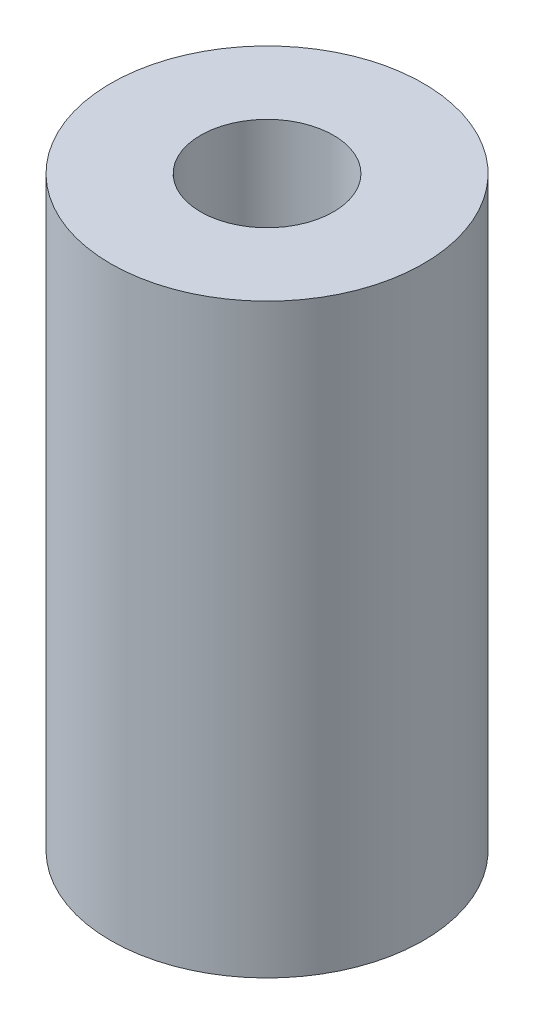
ISO-10303-21;
HEADER;
FILE_DESCRIPTION(('STEP AP214'),'2;1');
FILE_NAME('part.step','',(''),(''),'','','');
FILE_SCHEMA(('AUTOMOTIVE_DESIGN { 1 0 10303 214 1 1 1 1 }'));
ENDSEC;
DATA;
#1=APPLICATION_CONTEXT('core data for automotive mechanical design processes');
#2=APPLICATION_PROTOCOL_DEFINITION('international standard','automotive_design',2000,#1);
#3=PRODUCT_CONTEXT('',#1,'mechanical');
#4=PRODUCT('Part','Part','',(#3));
#5=PRODUCT_RELATED_PRODUCT_CATEGORY('part','',(#4));
#6=PRODUCT_DEFINITION_FORMATION('','',#4);
#7=PRODUCT_DEFINITION_CONTEXT('part definition',#1,'design');
#8=PRODUCT_DEFINITION('design','',#6,#7);
#9=PRODUCT_DEFINITION_SHAPE('','',#8);
#10=(LENGTH_UNIT() NAMED_UNIT(*) SI_UNIT(.MILLI.,.METRE.));
#11=(NAMED_UNIT(*) PLANE_ANGLE_UNIT() SI_UNIT($,.RADIAN.));
#12=(NAMED_UNIT(*) SI_UNIT($,.STERADIAN.) SOLID_ANGLE_UNIT());
#13=UNCERTAINTY_MEASURE_WITH_UNIT(LENGTH_MEASURE(1.E-05),#10,'distance_accuracy_value','');
#14=(GEOMETRIC_REPRESENTATION_CONTEXT(3) GLOBAL_UNCERTAINTY_ASSIGNED_CONTEXT((#13)) GLOBAL_UNIT_ASSIGNED_CONTEXT((#10,
#11,#12)) REPRESENTATION_CONTEXT('',''));
#15=CARTESIAN_POINT('',(0.,0.,0.));
#16=DIRECTION('',(0.,0.,1.));
#17=DIRECTION('',(1.,0.,0.));
#18=AXIS2_PLACEMENT_3D('',#15,#16,#17);
#19=CARTESIAN_POINT('',(0.,15.,0.));
#20=DIRECTION('',(0.,1.,0.));
#21=DIRECTION('',(0.,0.,1.));
#22=AXIS2_PLACEMENT_3D('',#19,#20,#21);
#23=PLANE('',#22);
#24=CARTESIAN_POINT('',(0.,15.,0.));
#25=DIRECTION('',(0.,1.,0.));
#26=DIRECTION('',(0.,0.,1.));
#27=AXIS2_PLACEMENT_3D('',#24,#25,#26);
#28=CIRCLE('',#27,4.);
#29=CARTESIAN_POINT('',(0.,15.,4.));
#30=VERTEX_POINT('',#29);
#31=EDGE_CURVE('E10',#30,#30,#28,.T.);
#32=ORIENTED_EDGE('',*,*,#31,.T.);
#33=EDGE_LOOP('',(#32));
#34=FACE_BOUND('',#33,.T.);
#35=CARTESIAN_POINT('',(0.,15.,0.));
#36=DIRECTION('',(0.,1.,0.));
#37=DIRECTION('',(0.,0.,1.));
#38=AXIS2_PLACEMENT_3D('',#35,#36,#37);
#39=CIRCLE('',#38,1.7);
#40=CARTESIAN_POINT('',(0.,15.,1.7));
#41=VERTEX_POINT('',#40);
#42=EDGE_CURVE('E43',#41,#41,#39,.T.);
#43=ORIENTED_EDGE('',*,*,#42,.F.);
#44=EDGE_LOOP('',(#43));
#45=FACE_BOUND('',#44,.T.);
#46=ADVANCED_FACE('F32',(#34,#45),#23,.T.);
#47=CARTESIAN_POINT('',(0.,0.,0.));
#48=DIRECTION('',(0.,1.,0.));
#49=DIRECTION('',(0.,0.,1.));
#50=AXIS2_PLACEMENT_3D('',#47,#48,#49);
#51=PLANE('',#50);
#52=CARTESIAN_POINT('',(0.,0.,0.));
#53=DIRECTION('',(0.,1.,0.));
#54=DIRECTION('',(0.,0.,1.));
#55=AXIS2_PLACEMENT_3D('',#52,#53,#54);
#56=CIRCLE('',#55,4.);
#57=CARTESIAN_POINT('',(0.,0.,4.));
#58=VERTEX_POINT('',#57);
#59=EDGE_CURVE('E36',#58,#58,#56,.T.);
#60=ORIENTED_EDGE('',*,*,#59,.F.);
#61=EDGE_LOOP('',(#60));
#62=FACE_BOUND('',#61,.T.);
#63=CARTESIAN_POINT('',(0.,0.,0.));
#64=DIRECTION('',(0.,1.,0.));
#65=DIRECTION('',(0.,0.,1.));
#66=AXIS2_PLACEMENT_3D('',#63,#64,#65);
#67=CIRCLE('',#66,1.7);
#68=CARTESIAN_POINT('',(0.,0.,1.7));
#69=VERTEX_POINT('',#68);
#70=EDGE_CURVE('E45',#69,#69,#67,.T.);
#71=ORIENTED_EDGE('',*,*,#70,.T.);
#72=EDGE_LOOP('',(#71));
#73=FACE_BOUND('',#72,.T.);
#74=ADVANCED_FACE('F55',(#62,#73),#51,.F.);
#75=CARTESIAN_POINT('',(0.,15.,0.));
#76=DIRECTION('',(0.,-1.,0.));
#77=DIRECTION('',(0.,0.,-1.));
#78=AXIS2_PLACEMENT_3D('',#75,#76,#77);
#79=CYLINDRICAL_SURFACE('',#78,4.);
#80=ORIENTED_EDGE('',*,*,#31,.F.);
#81=EDGE_LOOP('',(#80));
#82=FACE_BOUND('',#81,.T.);
#83=ORIENTED_EDGE('',*,*,#59,.T.);
#84=EDGE_LOOP('',(#83));
#85=FACE_BOUND('',#84,.T.);
#86=ADVANCED_FACE('F34',(#82,#85),#79,.T.);
#87=CARTESIAN_POINT('',(0.,15.,0.));
#88=DIRECTION('',(0.,-1.,0.));
#89=DIRECTION('',(0.,0.,-1.));
#90=AXIS2_PLACEMENT_3D('',#87,#88,#89);
#91=CYLINDRICAL_SURFACE('',#90,1.7);
#92=ORIENTED_EDGE('',*,*,#42,.T.);
#93=EDGE_LOOP('',(#92));
#94=FACE_BOUND('',#93,.T.);
#95=ORIENTED_EDGE('',*,*,#70,.F.);
#96=EDGE_LOOP('',(#95));
#97=FACE_BOUND('',#96,.T.);
#98=ADVANCED_FACE('F51',(#94,#97),#91,.F.);
#99=CLOSED_SHELL('',(#46,#74,#86,#98));
#100=MANIFOLD_SOLID_BREP('B2',#99);
#101=ADVANCED_BREP_SHAPE_REPRESENTATION('',(#18,#100),#14);
#102=SHAPE_DEFINITION_REPRESENTATION(#9,#101);
ENDSEC;
END-ISO-10303-21;
